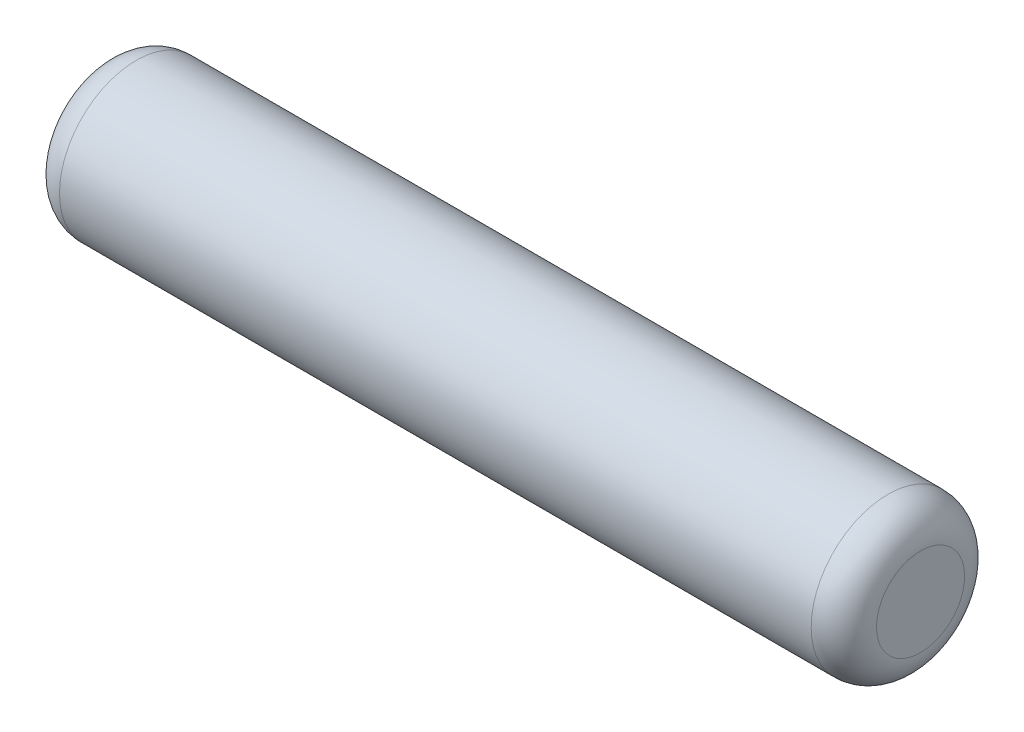
ISO-10303-21;
HEADER;
FILE_DESCRIPTION(('STEP AP214'),'2;1');
FILE_NAME('part.step','',(''),(''),'','','');
FILE_SCHEMA(('AUTOMOTIVE_DESIGN { 1 0 10303 214 1 1 1 1 }'));
ENDSEC;
DATA;
#1=APPLICATION_CONTEXT('core data for automotive mechanical design processes');
#2=APPLICATION_PROTOCOL_DEFINITION('international standard','automotive_design',2000,#1);
#3=PRODUCT_CONTEXT('',#1,'mechanical');
#4=PRODUCT('Part','Part','',(#3));
#5=PRODUCT_RELATED_PRODUCT_CATEGORY('part','',(#4));
#6=PRODUCT_DEFINITION_FORMATION('','',#4);
#7=PRODUCT_DEFINITION_CONTEXT('part definition',#1,'design');
#8=PRODUCT_DEFINITION('design','',#6,#7);
#9=PRODUCT_DEFINITION_SHAPE('','',#8);
#10=(LENGTH_UNIT() NAMED_UNIT(*) SI_UNIT(.MILLI.,.METRE.));
#11=(NAMED_UNIT(*) PLANE_ANGLE_UNIT() SI_UNIT($,.RADIAN.));
#12=(NAMED_UNIT(*) SI_UNIT($,.STERADIAN.) SOLID_ANGLE_UNIT());
#13=UNCERTAINTY_MEASURE_WITH_UNIT(LENGTH_MEASURE(1.E-05),#10,'distance_accuracy_value','');
#14=(GEOMETRIC_REPRESENTATION_CONTEXT(3) GLOBAL_UNCERTAINTY_ASSIGNED_CONTEXT((#13)) GLOBAL_UNIT_ASSIGNED_CONTEXT((#10,
#11,#12)) REPRESENTATION_CONTEXT('',''));
#15=CARTESIAN_POINT('',(0.,0.,0.));
#16=DIRECTION('',(0.,0.,1.));
#17=DIRECTION('',(1.,0.,0.));
#18=AXIS2_PLACEMENT_3D('',#15,#16,#17);
#19=CARTESIAN_POINT('',(0.,0.684529999999989,0.));
#20=DIRECTION('',(1.,0.,0.));
#21=DIRECTION('',(0.,0.,-1.));
#22=AXIS2_PLACEMENT_3D('',#19,#20,#21);
#23=PLANE('',#22);
#24=CARTESIAN_POINT('',(0.,0.,0.));
#25=DIRECTION('',(-1.,0.,0.));
#26=DIRECTION('',(0.,0.,1.));
#27=AXIS2_PLACEMENT_3D('',#24,#25,#26);
#28=CIRCLE('',#27,0.684529999999989);
#29=CARTESIAN_POINT('',(0.,0.,0.684529999999989));
#30=VERTEX_POINT('',#29);
#31=EDGE_CURVE('E46',#30,#30,#28,.T.);
#32=ORIENTED_EDGE('',*,*,#31,.T.);
#33=EDGE_LOOP('',(#32));
#34=FACE_BOUND('',#33,.T.);
#35=ADVANCED_FACE('F32',(#34),#23,.F.);
#36=CARTESIAN_POINT('',(12.7,0.,0.));
#37=DIRECTION('',(-1.,0.,0.));
#38=DIRECTION('',(0.,0.,1.));
#39=AXIS2_PLACEMENT_3D('',#36,#37,#38);
#40=PLANE('',#39);
#41=CARTESIAN_POINT('',(12.7,0.,0.));
#42=DIRECTION('',(-1.,0.,0.));
#43=DIRECTION('',(0.,0.,1.));
#44=AXIS2_PLACEMENT_3D('',#41,#42,#43);
#45=CIRCLE('',#44,0.684529999999993);
#46=CARTESIAN_POINT('',(12.7,0.,0.684529999999993));
#47=VERTEX_POINT('',#46);
#48=EDGE_CURVE('E10',#47,#47,#45,.T.);
#49=ORIENTED_EDGE('',*,*,#48,.F.);
#50=EDGE_LOOP('',(#49));
#51=FACE_BOUND('',#50,.T.);
#52=ADVANCED_FACE('F66',(#51),#40,.F.);
#53=CARTESIAN_POINT('',(12.192,0.,0.));
#54=DIRECTION('',(-1.,0.,0.));
#55=DIRECTION('',(0.,0.,1.));
#56=AXIS2_PLACEMENT_3D('',#53,#54,#55);
#57=TOROIDAL_SURFACE('',#56,0.684529999999993,0.508000000000001);
#58=CARTESIAN_POINT('',(12.192,0.,0.));
#59=DIRECTION('',(-1.,0.,0.));
#60=DIRECTION('',(0.,0.,1.));
#61=AXIS2_PLACEMENT_3D('',#58,#59,#60);
#62=CIRCLE('',#61,1.19252999999999);
#63=CARTESIAN_POINT('',(12.192,0.,1.19252999999999));
#64=VERTEX_POINT('',#63);
#65=EDGE_CURVE('E38',#64,#64,#62,.T.);
#66=ORIENTED_EDGE('',*,*,#65,.F.);
#67=EDGE_LOOP('',(#66));
#68=FACE_BOUND('',#67,.T.);
#69=ORIENTED_EDGE('',*,*,#48,.T.);
#70=EDGE_LOOP('',(#69));
#71=FACE_BOUND('',#70,.T.);
#72=ADVANCED_FACE('F61',(#68,#71),#57,.T.);
#73=CARTESIAN_POINT('',(-6.35,0.,0.));
#74=DIRECTION('',(-1.,0.,0.));
#75=DIRECTION('',(0.,0.,1.));
#76=AXIS2_PLACEMENT_3D('',#73,#74,#75);
#77=CYLINDRICAL_SURFACE('',#76,1.19252999999999);
#78=CARTESIAN_POINT('',(0.508,0.,0.));
#79=DIRECTION('',(-1.,0.,0.));
#80=DIRECTION('',(0.,0.,1.));
#81=AXIS2_PLACEMENT_3D('',#78,#79,#80);
#82=CIRCLE('',#81,1.19252999999999);
#83=CARTESIAN_POINT('',(0.508,0.,1.19252999999999));
#84=VERTEX_POINT('',#83);
#85=EDGE_CURVE('E42',#84,#84,#82,.T.);
#86=ORIENTED_EDGE('',*,*,#85,.F.);
#87=EDGE_LOOP('',(#86));
#88=FACE_BOUND('',#87,.T.);
#89=ORIENTED_EDGE('',*,*,#65,.T.);
#90=EDGE_LOOP('',(#89));
#91=FACE_BOUND('',#90,.T.);
#92=ADVANCED_FACE('F56',(#88,#91),#77,.T.);
#93=CARTESIAN_POINT('',(0.508,0.,0.));
#94=DIRECTION('',(-1.,0.,0.));
#95=DIRECTION('',(0.,0.,1.));
#96=AXIS2_PLACEMENT_3D('',#93,#94,#95);
#97=TOROIDAL_SURFACE('',#96,0.684529999999989,0.508);
#98=ORIENTED_EDGE('',*,*,#31,.F.);
#99=EDGE_LOOP('',(#98));
#100=FACE_BOUND('',#99,.T.);
#101=ORIENTED_EDGE('',*,*,#85,.T.);
#102=EDGE_LOOP('',(#101));
#103=FACE_BOUND('',#102,.T.);
#104=ADVANCED_FACE('F53',(#100,#103),#97,.T.);
#105=CLOSED_SHELL('',(#35,#52,#72,#92,#104));
#106=MANIFOLD_SOLID_BREP('B2',#105);
#107=ADVANCED_BREP_SHAPE_REPRESENTATION('',(#18,#106),#14);
#108=SHAPE_DEFINITION_REPRESENTATION(#9,#107);
ENDSEC;
END-ISO-10303-21;
